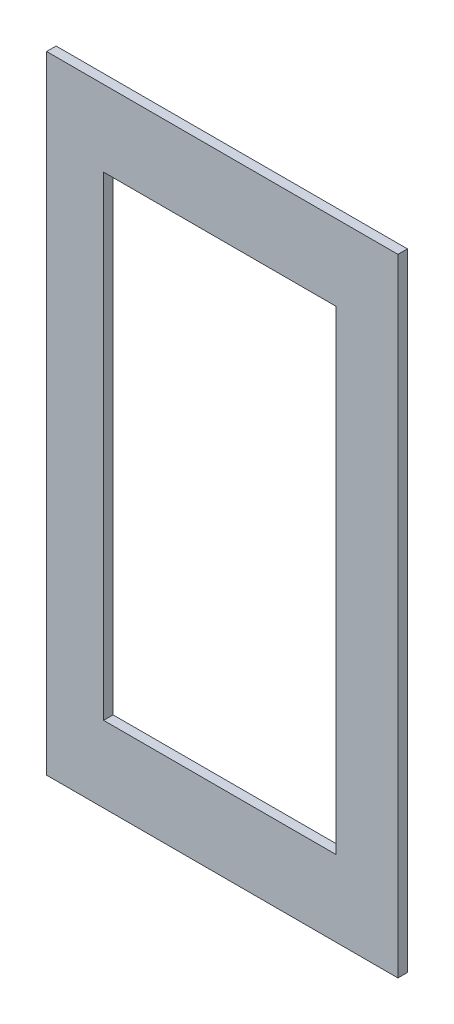
ISO-10303-21;
HEADER;
FILE_DESCRIPTION(('STEP AP214'),'2;1');
FILE_NAME('part.step','',(''),(''),'','','');
FILE_SCHEMA(('AUTOMOTIVE_DESIGN { 1 0 10303 214 1 1 1 1 }'));
ENDSEC;
DATA;
#1=APPLICATION_CONTEXT('core data for automotive mechanical design processes');
#2=APPLICATION_PROTOCOL_DEFINITION('international standard','automotive_design',2000,#1);
#3=PRODUCT_CONTEXT('',#1,'mechanical');
#4=PRODUCT('Part','Part','',(#3));
#5=PRODUCT_RELATED_PRODUCT_CATEGORY('part','',(#4));
#6=PRODUCT_DEFINITION_FORMATION('','',#4);
#7=PRODUCT_DEFINITION_CONTEXT('part definition',#1,'design');
#8=PRODUCT_DEFINITION('design','',#6,#7);
#9=PRODUCT_DEFINITION_SHAPE('','',#8);
#10=(LENGTH_UNIT() NAMED_UNIT(*) SI_UNIT(.MILLI.,.METRE.));
#11=(NAMED_UNIT(*) PLANE_ANGLE_UNIT() SI_UNIT($,.RADIAN.));
#12=(NAMED_UNIT(*) SI_UNIT($,.STERADIAN.) SOLID_ANGLE_UNIT());
#13=UNCERTAINTY_MEASURE_WITH_UNIT(LENGTH_MEASURE(1.E-05),#10,'distance_accuracy_value','');
#14=(GEOMETRIC_REPRESENTATION_CONTEXT(3) GLOBAL_UNCERTAINTY_ASSIGNED_CONTEXT((#13)) GLOBAL_UNIT_ASSIGNED_CONTEXT((#10,
#11,#12)) REPRESENTATION_CONTEXT('',''));
#15=CARTESIAN_POINT('',(0.,0.,0.));
#16=DIRECTION('',(0.,0.,1.));
#17=DIRECTION('',(1.,0.,0.));
#18=AXIS2_PLACEMENT_3D('',#15,#16,#17);
#19=CARTESIAN_POINT('',(117.475,419.1,-3.175));
#20=DIRECTION('',(-1.,0.,0.));
#21=DIRECTION('',(0.,0.,1.));
#22=AXIS2_PLACEMENT_3D('',#19,#20,#21);
#23=PLANE('',#22);
#24=DIRECTION('',(0.,0.,-1.));
#25=VECTOR('',#24,1.);
#26=CARTESIAN_POINT('',(117.475,0.,-3.175));
#27=LINE('',#26,#25);
#28=CARTESIAN_POINT('',(117.475,0.,3.175));
#29=VERTEX_POINT('',#28);
#30=CARTESIAN_POINT('',(117.475,0.,-3.175));
#31=VERTEX_POINT('',#30);
#32=EDGE_CURVE('E131',#29,#31,#27,.T.);
#33=ORIENTED_EDGE('',*,*,#32,.T.);
#34=DIRECTION('',(0.,-1.,0.));
#35=VECTOR('',#34,1.);
#36=CARTESIAN_POINT('',(117.475,419.1,-3.175));
#37=LINE('',#36,#35);
#38=CARTESIAN_POINT('',(117.475,419.1,-3.175));
#39=VERTEX_POINT('',#38);
#40=EDGE_CURVE('E11',#39,#31,#37,.T.);
#41=ORIENTED_EDGE('',*,*,#40,.F.);
#42=DIRECTION('',(0.,0.,-1.));
#43=VECTOR('',#42,1.);
#44=CARTESIAN_POINT('',(117.475,419.1,-3.175));
#45=LINE('',#44,#43);
#46=CARTESIAN_POINT('',(117.475,419.1,3.175));
#47=VERTEX_POINT('',#46);
#48=EDGE_CURVE('E135',#47,#39,#45,.T.);
#49=ORIENTED_EDGE('',*,*,#48,.F.);
#50=DIRECTION('',(0.,-1.,0.));
#51=VECTOR('',#50,1.);
#52=CARTESIAN_POINT('',(117.475,419.1,3.175));
#53=LINE('',#52,#51);
#54=EDGE_CURVE('E145',#47,#29,#53,.T.);
#55=ORIENTED_EDGE('',*,*,#54,.T.);
#56=EDGE_LOOP('',(#33,#41,#49,#55));
#57=FACE_BOUND('',#56,.T.);
#58=ADVANCED_FACE('F34',(#57),#23,.F.);
#59=CARTESIAN_POINT('',(-117.475,419.1,-3.175));
#60=DIRECTION('',(0.,0.,1.));
#61=DIRECTION('',(1.,0.,0.));
#62=AXIS2_PLACEMENT_3D('',#59,#60,#61);
#63=PLANE('',#62);
#64=DIRECTION('',(-1.,0.,0.));
#65=VECTOR('',#64,1.);
#66=CARTESIAN_POINT('',(-79.375,368.3,-3.175));
#67=LINE('',#66,#65);
#68=CARTESIAN_POINT('',(76.1999999999999,368.3,-3.175));
#69=VERTEX_POINT('',#68);
#70=CARTESIAN_POINT('',(-79.375,368.3,-3.175));
#71=VERTEX_POINT('',#70);
#72=EDGE_CURVE('E106',#69,#71,#67,.T.);
#73=ORIENTED_EDGE('',*,*,#72,.T.);
#74=DIRECTION('',(0.,-1.,0.));
#75=VECTOR('',#74,1.);
#76=CARTESIAN_POINT('',(-79.375,368.3,-3.175));
#77=LINE('',#76,#75);
#78=CARTESIAN_POINT('',(-79.3749999999999,50.8,-3.175));
#79=VERTEX_POINT('',#78);
#80=EDGE_CURVE('E100',#71,#79,#77,.T.);
#81=ORIENTED_EDGE('',*,*,#80,.T.);
#82=DIRECTION('',(1.,0.,0.));
#83=VECTOR('',#82,1.);
#84=CARTESIAN_POINT('',(-79.3749999999999,50.8,-3.175));
#85=LINE('',#84,#83);
#86=CARTESIAN_POINT('',(76.2,50.8,-3.175));
#87=VERTEX_POINT('',#86);
#88=EDGE_CURVE('E109',#79,#87,#85,.T.);
#89=ORIENTED_EDGE('',*,*,#88,.T.);
#90=DIRECTION('',(0.,1.,0.));
#91=VECTOR('',#90,1.);
#92=CARTESIAN_POINT('',(76.1999999999999,368.3,-3.175));
#93=LINE('',#92,#91);
#94=EDGE_CURVE('E48',#87,#69,#93,.T.);
#95=ORIENTED_EDGE('',*,*,#94,.T.);
#96=EDGE_LOOP('',(#73,#81,#89,#95));
#97=FACE_BOUND('',#96,.T.);
#98=DIRECTION('',(-1.,0.,0.));
#99=VECTOR('',#98,1.);
#100=CARTESIAN_POINT('',(-117.475,0.,-3.175));
#101=LINE('',#100,#99);
#102=CARTESIAN_POINT('',(-117.475,0.,-3.175));
#103=VERTEX_POINT('',#102);
#104=EDGE_CURVE('E148',#31,#103,#101,.T.);
#105=ORIENTED_EDGE('',*,*,#104,.T.);
#106=DIRECTION('',(0.,-1.,0.));
#107=VECTOR('',#106,1.);
#108=CARTESIAN_POINT('',(-117.475,419.1,-3.175));
#109=LINE('',#108,#107);
#110=CARTESIAN_POINT('',(-117.475,419.1,-3.175));
#111=VERTEX_POINT('',#110);
#112=EDGE_CURVE('E41',#111,#103,#109,.T.);
#113=ORIENTED_EDGE('',*,*,#112,.F.);
#114=DIRECTION('',(-1.,0.,0.));
#115=VECTOR('',#114,1.);
#116=CARTESIAN_POINT('',(-117.475,419.1,-3.175));
#117=LINE('',#116,#115);
#118=EDGE_CURVE('E138',#39,#111,#117,.T.);
#119=ORIENTED_EDGE('',*,*,#118,.F.);
#120=ORIENTED_EDGE('',*,*,#40,.T.);
#121=EDGE_LOOP('',(#105,#113,#119,#120));
#122=FACE_BOUND('',#121,.T.);
#123=ADVANCED_FACE('F113',(#97,#122),#63,.F.);
#124=CARTESIAN_POINT('',(-117.475,419.1,-3.175));
#125=DIRECTION('',(1.,0.,0.));
#126=DIRECTION('',(0.,0.,-1.));
#127=AXIS2_PLACEMENT_3D('',#124,#125,#126);
#128=PLANE('',#127);
#129=DIRECTION('',(0.,0.,1.));
#130=VECTOR('',#129,1.);
#131=CARTESIAN_POINT('',(-117.475,0.,-3.175));
#132=LINE('',#131,#130);
#133=CARTESIAN_POINT('',(-117.475,0.,3.175));
#134=VERTEX_POINT('',#133);
#135=EDGE_CURVE('E150',#103,#134,#132,.T.);
#136=ORIENTED_EDGE('',*,*,#135,.T.);
#137=DIRECTION('',(0.,-1.,0.));
#138=VECTOR('',#137,1.);
#139=CARTESIAN_POINT('',(-117.475,419.1,3.175));
#140=LINE('',#139,#138);
#141=CARTESIAN_POINT('',(-117.475,419.1,3.175));
#142=VERTEX_POINT('',#141);
#143=EDGE_CURVE('E155',#142,#134,#140,.T.);
#144=ORIENTED_EDGE('',*,*,#143,.F.);
#145=DIRECTION('',(0.,0.,1.));
#146=VECTOR('',#145,1.);
#147=CARTESIAN_POINT('',(-117.475,419.1,-3.175));
#148=LINE('',#147,#146);
#149=EDGE_CURVE('E141',#111,#142,#148,.T.);
#150=ORIENTED_EDGE('',*,*,#149,.F.);
#151=ORIENTED_EDGE('',*,*,#112,.T.);
#152=EDGE_LOOP('',(#136,#144,#150,#151));
#153=FACE_BOUND('',#152,.T.);
#154=ADVANCED_FACE('F162',(#153),#128,.F.);
#155=CARTESIAN_POINT('',(-117.475,419.1,3.175));
#156=DIRECTION('',(0.,0.,-1.));
#157=DIRECTION('',(-1.,0.,0.));
#158=AXIS2_PLACEMENT_3D('',#155,#156,#157);
#159=PLANE('',#158);
#160=DIRECTION('',(1.,0.,0.));
#161=VECTOR('',#160,1.);
#162=CARTESIAN_POINT('',(-79.3749999999999,50.8,3.175));
#163=LINE('',#162,#161);
#164=CARTESIAN_POINT('',(-79.3749999999999,50.8,3.175));
#165=VERTEX_POINT('',#164);
#166=CARTESIAN_POINT('',(76.2,50.8,3.175));
#167=VERTEX_POINT('',#166);
#168=EDGE_CURVE('E125',#165,#167,#163,.T.);
#169=ORIENTED_EDGE('',*,*,#168,.F.);
#170=DIRECTION('',(0.,-1.,0.));
#171=VECTOR('',#170,1.);
#172=CARTESIAN_POINT('',(-79.375,368.3,3.175));
#173=LINE('',#172,#171);
#174=CARTESIAN_POINT('',(-79.375,368.3,3.175));
#175=VERTEX_POINT('',#174);
#176=EDGE_CURVE('E56',#175,#165,#173,.T.);
#177=ORIENTED_EDGE('',*,*,#176,.F.);
#178=DIRECTION('',(-1.,0.,0.));
#179=VECTOR('',#178,1.);
#180=CARTESIAN_POINT('',(-79.375,368.3,3.175));
#181=LINE('',#180,#179);
#182=CARTESIAN_POINT('',(76.1999999999999,368.3,3.175));
#183=VERTEX_POINT('',#182);
#184=EDGE_CURVE('E116',#183,#175,#181,.T.);
#185=ORIENTED_EDGE('',*,*,#184,.F.);
#186=DIRECTION('',(0.,1.,0.));
#187=VECTOR('',#186,1.);
#188=CARTESIAN_POINT('',(76.1999999999999,368.3,3.175));
#189=LINE('',#188,#187);
#190=EDGE_CURVE('E119',#167,#183,#189,.T.);
#191=ORIENTED_EDGE('',*,*,#190,.F.);
#192=EDGE_LOOP('',(#169,#177,#185,#191));
#193=FACE_BOUND('',#192,.T.);
#194=DIRECTION('',(1.,0.,0.));
#195=VECTOR('',#194,1.);
#196=CARTESIAN_POINT('',(-117.475,0.,3.175));
#197=LINE('',#196,#195);
#198=EDGE_CURVE('E139',#134,#29,#197,.T.);
#199=ORIENTED_EDGE('',*,*,#198,.T.);
#200=ORIENTED_EDGE('',*,*,#54,.F.);
#201=DIRECTION('',(1.,0.,0.));
#202=VECTOR('',#201,1.);
#203=CARTESIAN_POINT('',(-117.475,419.1,3.175));
#204=LINE('',#203,#202);
#205=EDGE_CURVE('E143',#142,#47,#204,.T.);
#206=ORIENTED_EDGE('',*,*,#205,.F.);
#207=ORIENTED_EDGE('',*,*,#143,.T.);
#208=EDGE_LOOP('',(#199,#200,#206,#207));
#209=FACE_BOUND('',#208,.T.);
#210=ADVANCED_FACE('F170',(#193,#209),#159,.F.);
#211=CARTESIAN_POINT('',(0.,419.1,0.));
#212=DIRECTION('',(0.,1.,0.));
#213=DIRECTION('',(0.,0.,1.));
#214=AXIS2_PLACEMENT_3D('',#211,#212,#213);
#215=PLANE('',#214);
#216=ORIENTED_EDGE('',*,*,#48,.T.);
#217=ORIENTED_EDGE('',*,*,#118,.T.);
#218=ORIENTED_EDGE('',*,*,#149,.T.);
#219=ORIENTED_EDGE('',*,*,#205,.T.);
#220=EDGE_LOOP('',(#216,#217,#218,#219));
#221=FACE_BOUND('',#220,.T.);
#222=ADVANCED_FACE('F176',(#221),#215,.T.);
#223=CARTESIAN_POINT('',(0.,0.,0.));
#224=DIRECTION('',(0.,1.,0.));
#225=DIRECTION('',(0.,0.,1.));
#226=AXIS2_PLACEMENT_3D('',#223,#224,#225);
#227=PLANE('',#226);
#228=ORIENTED_EDGE('',*,*,#32,.F.);
#229=ORIENTED_EDGE('',*,*,#198,.F.);
#230=ORIENTED_EDGE('',*,*,#135,.F.);
#231=ORIENTED_EDGE('',*,*,#104,.F.);
#232=EDGE_LOOP('',(#228,#229,#230,#231));
#233=FACE_BOUND('',#232,.T.);
#234=ADVANCED_FACE('F167',(#233),#227,.F.);
#235=CARTESIAN_POINT('',(-79.375,368.3,-3.175));
#236=DIRECTION('',(-1.,0.,0.));
#237=DIRECTION('',(0.,-1.,0.));
#238=AXIS2_PLACEMENT_3D('',#235,#236,#237);
#239=PLANE('',#238);
#240=ORIENTED_EDGE('',*,*,#176,.T.);
#241=DIRECTION('',(0.,0.,1.));
#242=VECTOR('',#241,1.);
#243=CARTESIAN_POINT('',(-79.3749999999999,50.8,-3.175));
#244=LINE('',#243,#242);
#245=EDGE_CURVE('E96',#79,#165,#244,.T.);
#246=ORIENTED_EDGE('',*,*,#245,.F.);
#247=ORIENTED_EDGE('',*,*,#80,.F.);
#248=DIRECTION('',(0.,0.,1.));
#249=VECTOR('',#248,1.);
#250=CARTESIAN_POINT('',(-79.375,368.3,-3.175));
#251=LINE('',#250,#249);
#252=EDGE_CURVE('E129',#71,#175,#251,.T.);
#253=ORIENTED_EDGE('',*,*,#252,.T.);
#254=EDGE_LOOP('',(#240,#246,#247,#253));
#255=FACE_BOUND('',#254,.T.);
#256=ADVANCED_FACE('F98',(#255),#239,.F.);
#257=CARTESIAN_POINT('',(-79.375,368.3,-3.175));
#258=DIRECTION('',(0.,1.,0.));
#259=DIRECTION('',(0.,0.,1.));
#260=AXIS2_PLACEMENT_3D('',#257,#258,#259);
#261=PLANE('',#260);
#262=ORIENTED_EDGE('',*,*,#184,.T.);
#263=ORIENTED_EDGE('',*,*,#252,.F.);
#264=ORIENTED_EDGE('',*,*,#72,.F.);
#265=DIRECTION('',(0.,0.,1.));
#266=VECTOR('',#265,1.);
#267=CARTESIAN_POINT('',(76.1999999999999,368.3,-3.175));
#268=LINE('',#267,#266);
#269=EDGE_CURVE('E132',#69,#183,#268,.T.);
#270=ORIENTED_EDGE('',*,*,#269,.T.);
#271=EDGE_LOOP('',(#262,#263,#264,#270));
#272=FACE_BOUND('',#271,.T.);
#273=ADVANCED_FACE('F193',(#272),#261,.F.);
#274=CARTESIAN_POINT('',(76.1999999999999,368.3,-3.175));
#275=DIRECTION('',(1.,0.,0.));
#276=DIRECTION('',(0.,1.,0.));
#277=AXIS2_PLACEMENT_3D('',#274,#275,#276);
#278=PLANE('',#277);
#279=ORIENTED_EDGE('',*,*,#190,.T.);
#280=ORIENTED_EDGE('',*,*,#269,.F.);
#281=ORIENTED_EDGE('',*,*,#94,.F.);
#282=DIRECTION('',(0.,0.,1.));
#283=VECTOR('',#282,1.);
#284=CARTESIAN_POINT('',(76.2,50.8,-3.175));
#285=LINE('',#284,#283);
#286=EDGE_CURVE('E105',#87,#167,#285,.T.);
#287=ORIENTED_EDGE('',*,*,#286,.T.);
#288=EDGE_LOOP('',(#279,#280,#281,#287));
#289=FACE_BOUND('',#288,.T.);
#290=ADVANCED_FACE('F196',(#289),#278,.F.);
#291=CARTESIAN_POINT('',(-79.3749999999999,50.8,-3.175));
#292=DIRECTION('',(0.,-1.,0.));
#293=DIRECTION('',(0.,0.,-1.));
#294=AXIS2_PLACEMENT_3D('',#291,#292,#293);
#295=PLANE('',#294);
#296=ORIENTED_EDGE('',*,*,#168,.T.);
#297=ORIENTED_EDGE('',*,*,#286,.F.);
#298=ORIENTED_EDGE('',*,*,#88,.F.);
#299=ORIENTED_EDGE('',*,*,#245,.T.);
#300=EDGE_LOOP('',(#296,#297,#298,#299));
#301=FACE_BOUND('',#300,.T.);
#302=ADVANCED_FACE('F110',(#301),#295,.F.);
#303=CLOSED_SHELL('',(#58,#123,#154,#210,#222,#234,#256,#273,#290,#302));
#304=MANIFOLD_SOLID_BREP('B2',#303);
#305=ADVANCED_BREP_SHAPE_REPRESENTATION('',(#18,#304),#14);
#306=SHAPE_DEFINITION_REPRESENTATION(#9,#305);
ENDSEC;
END-ISO-10303-21;
